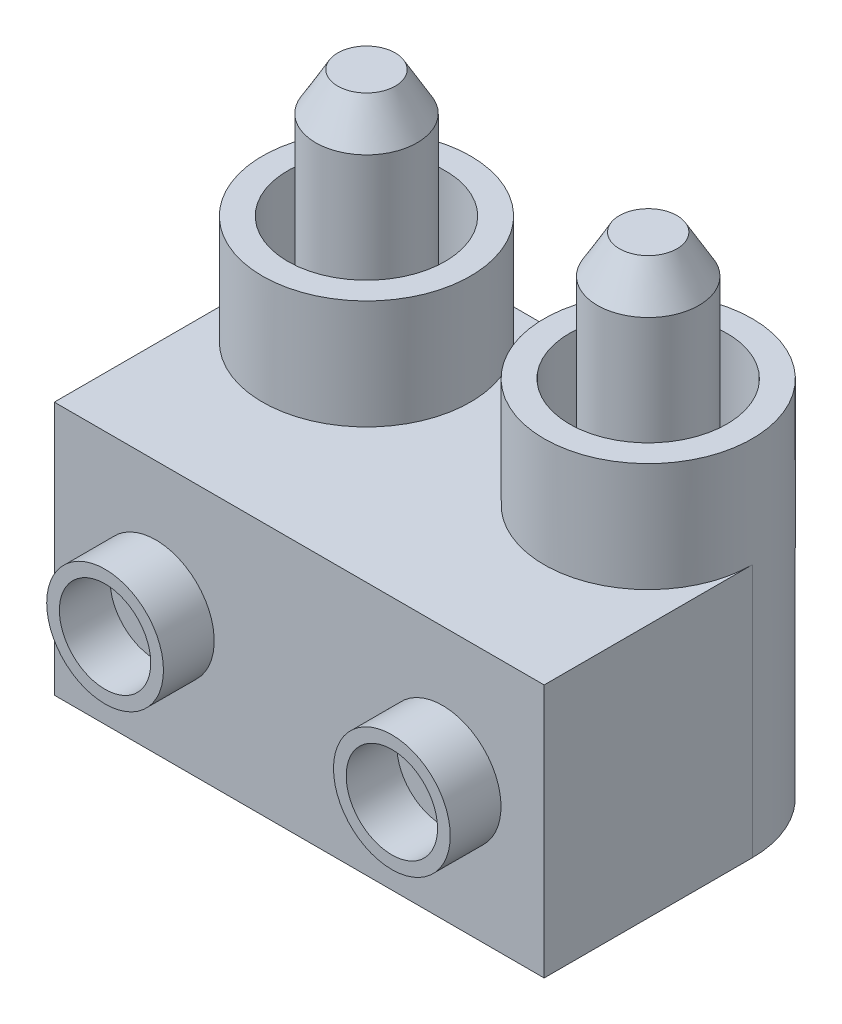
ISO-10303-21;
HEADER;
FILE_DESCRIPTION(('STEP AP214'),'2;1');
FILE_NAME('part.step','',(''),(''),'','','');
FILE_SCHEMA(('AUTOMOTIVE_DESIGN { 1 0 10303 214 1 1 1 1 }'));
ENDSEC;
DATA;
#1=APPLICATION_CONTEXT('core data for automotive mechanical design processes');
#2=APPLICATION_PROTOCOL_DEFINITION('international standard','automotive_design',2000,#1);
#3=PRODUCT_CONTEXT('',#1,'mechanical');
#4=PRODUCT('Part','Part','',(#3));
#5=PRODUCT_RELATED_PRODUCT_CATEGORY('part','',(#4));
#6=PRODUCT_DEFINITION_FORMATION('','',#4);
#7=PRODUCT_DEFINITION_CONTEXT('part definition',#1,'design');
#8=PRODUCT_DEFINITION('design','',#6,#7);
#9=PRODUCT_DEFINITION_SHAPE('','',#8);
#10=(LENGTH_UNIT() NAMED_UNIT(*) SI_UNIT(.MILLI.,.METRE.));
#11=(NAMED_UNIT(*) PLANE_ANGLE_UNIT() SI_UNIT($,.RADIAN.));
#12=(NAMED_UNIT(*) SI_UNIT($,.STERADIAN.) SOLID_ANGLE_UNIT());
#13=UNCERTAINTY_MEASURE_WITH_UNIT(LENGTH_MEASURE(1.E-05),#10,'distance_accuracy_value','');
#14=(GEOMETRIC_REPRESENTATION_CONTEXT(3) GLOBAL_UNCERTAINTY_ASSIGNED_CONTEXT((#13)) GLOBAL_UNIT_ASSIGNED_CONTEXT((#10,
#11,#12)) REPRESENTATION_CONTEXT('',''));
#15=CARTESIAN_POINT('',(0.,0.,0.));
#16=DIRECTION('',(0.,0.,1.));
#17=DIRECTION('',(1.,0.,0.));
#18=AXIS2_PLACEMENT_3D('',#15,#16,#17);
#19=CARTESIAN_POINT('',(5.55,19.3,-2.05));
#20=DIRECTION('',(0.,-1.,0.));
#21=DIRECTION('',(0.,0.,-1.));
#22=AXIS2_PLACEMENT_3D('',#19,#20,#21);
#23=CYLINDRICAL_SURFACE('',#22,2.);
#24=CARTESIAN_POINT('',(5.55,17.8,-2.05));
#25=DIRECTION('',(0.,1.,0.));
#26=DIRECTION('',(0.,0.,1.));
#27=AXIS2_PLACEMENT_3D('',#24,#25,#26);
#28=CIRCLE('',#27,2.);
#29=CARTESIAN_POINT('',(5.55,17.8,-0.0500000000000001));
#30=VERTEX_POINT('',#29);
#31=EDGE_CURVE('E11',#30,#30,#28,.F.);
#32=ORIENTED_EDGE('',*,*,#31,.T.);
#33=EDGE_LOOP('',(#32));
#34=FACE_BOUND('',#33,.T.);
#35=CARTESIAN_POINT('',(5.55,10.,-2.05));
#36=DIRECTION('',(0.,1.,0.));
#37=DIRECTION('',(0.,0.,1.));
#38=AXIS2_PLACEMENT_3D('',#35,#36,#37);
#39=CIRCLE('',#38,2.);
#40=CARTESIAN_POINT('',(5.55,10.,-0.0500000000000001));
#41=VERTEX_POINT('',#40);
#42=EDGE_CURVE('E68',#41,#41,#39,.T.);
#43=ORIENTED_EDGE('',*,*,#42,.T.);
#44=EDGE_LOOP('',(#43));
#45=FACE_BOUND('',#44,.T.);
#46=ADVANCED_FACE('F56',(#34,#45),#23,.T.);
#47=CARTESIAN_POINT('',(5.55,19.3,-2.05));
#48=DIRECTION('',(0.,1.,0.));
#49=DIRECTION('',(0.,0.,1.));
#50=AXIS2_PLACEMENT_3D('',#47,#48,#49);
#51=PLANE('',#50);
#52=CARTESIAN_POINT('',(5.55,19.3,-2.05));
#53=DIRECTION('',(0.,1.,0.));
#54=DIRECTION('',(0.,0.,1.));
#55=AXIS2_PLACEMENT_3D('',#52,#53,#54);
#56=CIRCLE('',#55,1.13397459621556);
#57=CARTESIAN_POINT('',(5.55,19.3,-0.91602540378444));
#58=VERTEX_POINT('',#57);
#59=EDGE_CURVE('E64',#58,#58,#56,.T.);
#60=ORIENTED_EDGE('',*,*,#59,.T.);
#61=EDGE_LOOP('',(#60));
#62=FACE_BOUND('',#61,.T.);
#63=ADVANCED_FACE('F78',(#62),#51,.T.);
#64=CARTESIAN_POINT('',(5.55,10.,-2.05));
#65=DIRECTION('',(0.,1.,0.));
#66=DIRECTION('',(0.,0.,1.));
#67=AXIS2_PLACEMENT_3D('',#64,#65,#66);
#68=PLANE('',#67);
#69=ORIENTED_EDGE('',*,*,#42,.F.);
#70=EDGE_LOOP('',(#69));
#71=FACE_BOUND('',#70,.T.);
#72=ADVANCED_FACE('F76',(#71),#68,.F.);
#73=CARTESIAN_POINT('',(5.55,19.3,-2.05));
#74=DIRECTION('',(0.,-1.,0.));
#75=DIRECTION('',(0.,0.,-1.));
#76=AXIS2_PLACEMENT_3D('',#73,#74,#75);
#77=CONICAL_SURFACE('',#76,1.13397459621556,0.523598775598296);
#78=ORIENTED_EDGE('',*,*,#31,.F.);
#79=EDGE_LOOP('',(#78));
#80=FACE_BOUND('',#79,.T.);
#81=ORIENTED_EDGE('',*,*,#59,.F.);
#82=EDGE_LOOP('',(#81));
#83=FACE_BOUND('',#82,.T.);
#84=ADVANCED_FACE('F59',(#80,#83),#77,.T.);
#85=CLOSED_SHELL('',(#46,#63,#72,#84));
#86=MANIFOLD_SOLID_BREP('B2',#85);
#87=CARTESIAN_POINT('',(-5.55,19.3,-2.05));
#88=DIRECTION('',(0.,-1.,0.));
#89=DIRECTION('',(0.,0.,-1.));
#90=AXIS2_PLACEMENT_3D('',#87,#88,#89);
#91=CYLINDRICAL_SURFACE('',#90,2.);
#92=CARTESIAN_POINT('',(-5.55,17.8,-2.05));
#93=DIRECTION('',(0.,1.,0.));
#94=DIRECTION('',(0.,0.,1.));
#95=AXIS2_PLACEMENT_3D('',#92,#93,#94);
#96=CIRCLE('',#95,2.);
#97=CARTESIAN_POINT('',(-5.55,17.8,-0.0500000000000001));
#98=VERTEX_POINT('',#97);
#99=EDGE_CURVE('E55',#98,#98,#96,.F.);
#100=ORIENTED_EDGE('',*,*,#99,.T.);
#101=EDGE_LOOP('',(#100));
#102=FACE_BOUND('',#101,.T.);
#103=CARTESIAN_POINT('',(-5.55,10.,-2.05));
#104=DIRECTION('',(0.,1.,0.));
#105=DIRECTION('',(0.,0.,1.));
#106=AXIS2_PLACEMENT_3D('',#103,#104,#105);
#107=CIRCLE('',#106,2.);
#108=CARTESIAN_POINT('',(-5.55,10.,-0.0500000000000001));
#109=VERTEX_POINT('',#108);
#110=EDGE_CURVE('E148',#109,#109,#107,.T.);
#111=ORIENTED_EDGE('',*,*,#110,.T.);
#112=EDGE_LOOP('',(#111));
#113=FACE_BOUND('',#112,.T.);
#114=ADVANCED_FACE('F136',(#102,#113),#91,.T.);
#115=CARTESIAN_POINT('',(-5.55,19.3,-2.05));
#116=DIRECTION('',(0.,1.,0.));
#117=DIRECTION('',(0.,0.,1.));
#118=AXIS2_PLACEMENT_3D('',#115,#116,#117);
#119=PLANE('',#118);
#120=CARTESIAN_POINT('',(-5.55,19.3,-2.05));
#121=DIRECTION('',(0.,1.,0.));
#122=DIRECTION('',(0.,0.,1.));
#123=AXIS2_PLACEMENT_3D('',#120,#121,#122);
#124=CIRCLE('',#123,1.13397459621556);
#125=CARTESIAN_POINT('',(-5.55,19.3,-0.91602540378444));
#126=VERTEX_POINT('',#125);
#127=EDGE_CURVE('E144',#126,#126,#124,.T.);
#128=ORIENTED_EDGE('',*,*,#127,.T.);
#129=EDGE_LOOP('',(#128));
#130=FACE_BOUND('',#129,.T.);
#131=ADVANCED_FACE('F158',(#130),#119,.T.);
#132=CARTESIAN_POINT('',(-5.55,10.,-2.05));
#133=DIRECTION('',(0.,1.,0.));
#134=DIRECTION('',(0.,0.,1.));
#135=AXIS2_PLACEMENT_3D('',#132,#133,#134);
#136=PLANE('',#135);
#137=ORIENTED_EDGE('',*,*,#110,.F.);
#138=EDGE_LOOP('',(#137));
#139=FACE_BOUND('',#138,.T.);
#140=ADVANCED_FACE('F156',(#139),#136,.F.);
#141=CARTESIAN_POINT('',(-5.55,19.3,-2.05));
#142=DIRECTION('',(0.,-1.,0.));
#143=DIRECTION('',(0.,0.,-1.));
#144=AXIS2_PLACEMENT_3D('',#141,#142,#143);
#145=CONICAL_SURFACE('',#144,1.13397459621556,0.523598775598296);
#146=ORIENTED_EDGE('',*,*,#99,.F.);
#147=EDGE_LOOP('',(#146));
#148=FACE_BOUND('',#147,.T.);
#149=ORIENTED_EDGE('',*,*,#127,.F.);
#150=EDGE_LOOP('',(#149));
#151=FACE_BOUND('',#150,.T.);
#152=ADVANCED_FACE('F139',(#148,#151),#145,.T.);
#153=CLOSED_SHELL('',(#114,#131,#140,#152));
#154=MANIFOLD_SOLID_BREP('B6',#153);
#155=CARTESIAN_POINT('',(9.65,10.,-2.04999999999997));
#156=DIRECTION('',(-1.,0.,0.));
#157=DIRECTION('',(0.,0.,1.));
#158=AXIS2_PLACEMENT_3D('',#155,#156,#157);
#159=PLANE('',#158);
#160=DIRECTION('',(0.,0.,-1.));
#161=VECTOR('',#160,1.);
#162=CARTESIAN_POINT('',(9.65,0.,-2.04999999999997));
#163=LINE('',#162,#161);
#164=CARTESIAN_POINT('',(9.65,0.,6.15));
#165=VERTEX_POINT('',#164);
#166=CARTESIAN_POINT('',(9.65,0.,-2.04999999999997));
#167=VERTEX_POINT('',#166);
#168=EDGE_CURVE('E285',#165,#167,#163,.T.);
#169=ORIENTED_EDGE('',*,*,#168,.T.);
#170=DIRECTION('',(0.,-1.,0.));
#171=VECTOR('',#170,1.);
#172=CARTESIAN_POINT('',(9.65,10.,-2.04999999999997));
#173=LINE('',#172,#171);
#174=CARTESIAN_POINT('',(9.65,10.,-2.05));
#175=VERTEX_POINT('',#174);
#176=EDGE_CURVE('E271',#175,#167,#173,.T.);
#177=ORIENTED_EDGE('',*,*,#176,.F.);
#178=DIRECTION('',(0.,0.,-1.));
#179=VECTOR('',#178,1.);
#180=CARTESIAN_POINT('',(9.65,10.,-2.04999999999997));
#181=LINE('',#180,#179);
#182=CARTESIAN_POINT('',(9.65,10.,6.15));
#183=VERTEX_POINT('',#182);
#184=EDGE_CURVE('E279',#183,#175,#181,.T.);
#185=ORIENTED_EDGE('',*,*,#184,.F.);
#186=DIRECTION('',(0.,-1.,0.));
#187=VECTOR('',#186,1.);
#188=CARTESIAN_POINT('',(9.65,10.,6.15));
#189=LINE('',#188,#187);
#190=EDGE_CURVE('E365',#183,#165,#189,.T.);
#191=ORIENTED_EDGE('',*,*,#190,.T.);
#192=EDGE_LOOP('',(#169,#177,#185,#191));
#193=FACE_BOUND('',#192,.T.);
#194=ADVANCED_FACE('F207',(#193),#159,.F.);
#195=CARTESIAN_POINT('',(5.55,10.,-2.05));
#196=DIRECTION('',(0.,-1.,0.));
#197=DIRECTION('',(0.,0.,-1.));
#198=AXIS2_PLACEMENT_3D('',#195,#196,#197);
#199=CYLINDRICAL_SURFACE('',#198,4.1);
#200=CARTESIAN_POINT('',(5.55,0.,-2.05));
#201=DIRECTION('',(0.,1.,0.));
#202=DIRECTION('',(0.,0.,1.));
#203=AXIS2_PLACEMENT_3D('',#200,#201,#202);
#204=CIRCLE('',#203,4.1);
#205=CARTESIAN_POINT('',(5.54999999999997,0.,-6.15));
#206=VERTEX_POINT('',#205);
#207=EDGE_CURVE('E355',#167,#206,#204,.T.);
#208=ORIENTED_EDGE('',*,*,#207,.T.);
#209=DIRECTION('',(0.,-1.,0.));
#210=VECTOR('',#209,1.);
#211=CARTESIAN_POINT('',(5.54999999999997,10.,-6.15));
#212=LINE('',#211,#210);
#213=CARTESIAN_POINT('',(5.54999999999997,10.,-6.15));
#214=VERTEX_POINT('',#213);
#215=EDGE_CURVE('E274',#214,#206,#212,.T.);
#216=ORIENTED_EDGE('',*,*,#215,.F.);
#217=CARTESIAN_POINT('',(5.55,10.,-2.05));
#218=DIRECTION('',(0.,1.,0.));
#219=DIRECTION('',(0.,0.,1.));
#220=AXIS2_PLACEMENT_3D('',#217,#218,#219);
#221=CIRCLE('',#220,4.1);
#222=EDGE_CURVE('E259',#175,#214,#221,.F.);
#223=ORIENTED_EDGE('',*,*,#222,.F.);
#224=ORIENTED_EDGE('',*,*,#176,.T.);
#225=EDGE_LOOP('',(#208,#216,#223,#224));
#226=FACE_BOUND('',#225,.T.);
#227=CARTESIAN_POINT('',(5.55,14.3,-2.05));
#228=DIRECTION('',(0.,1.,0.));
#229=DIRECTION('',(0.,0.,1.));
#230=AXIS2_PLACEMENT_3D('',#227,#228,#229);
#231=CIRCLE('',#230,4.1);
#232=CARTESIAN_POINT('',(5.55,14.3,2.05));
#233=VERTEX_POINT('',#232);
#234=EDGE_CURVE('E439',#233,#233,#231,.T.);
#235=ORIENTED_EDGE('',*,*,#234,.F.);
#236=EDGE_LOOP('',(#235));
#237=FACE_BOUND('',#236,.T.);
#238=ADVANCED_FACE('F268',(#226,#237),#199,.T.);
#239=CARTESIAN_POINT('',(-5.54999999999997,10.,-6.15));
#240=DIRECTION('',(0.,0.,1.));
#241=DIRECTION('',(1.,0.,0.));
#242=AXIS2_PLACEMENT_3D('',#239,#240,#241);
#243=PLANE('',#242);
#244=DIRECTION('',(-1.,0.,0.));
#245=VECTOR('',#244,1.);
#246=CARTESIAN_POINT('',(-5.54999999999997,0.,-6.15));
#247=LINE('',#246,#245);
#248=CARTESIAN_POINT('',(-5.54999999999997,0.,-6.15));
#249=VERTEX_POINT('',#248);
#250=EDGE_CURVE('E368',#206,#249,#247,.T.);
#251=ORIENTED_EDGE('',*,*,#250,.T.);
#252=DIRECTION('',(0.,-1.,0.));
#253=VECTOR('',#252,1.);
#254=CARTESIAN_POINT('',(-5.54999999999997,10.,-6.15));
#255=LINE('',#254,#253);
#256=CARTESIAN_POINT('',(-5.55,10.,-6.15));
#257=VERTEX_POINT('',#256);
#258=EDGE_CURVE('E290',#257,#249,#255,.T.);
#259=ORIENTED_EDGE('',*,*,#258,.F.);
#260=DIRECTION('',(-1.,0.,0.));
#261=VECTOR('',#260,1.);
#262=CARTESIAN_POINT('',(-5.54999999999997,10.,-6.15));
#263=LINE('',#262,#261);
#264=EDGE_CURVE('E282',#214,#257,#263,.T.);
#265=ORIENTED_EDGE('',*,*,#264,.F.);
#266=ORIENTED_EDGE('',*,*,#215,.T.);
#267=EDGE_LOOP('',(#251,#259,#265,#266));
#268=FACE_BOUND('',#267,.T.);
#269=ADVANCED_FACE('F333',(#268),#243,.F.);
#270=CARTESIAN_POINT('',(-5.55,10.,-2.05));
#271=DIRECTION('',(0.,-1.,0.));
#272=DIRECTION('',(0.,0.,-1.));
#273=AXIS2_PLACEMENT_3D('',#270,#271,#272);
#274=CYLINDRICAL_SURFACE('',#273,4.1);
#275=CARTESIAN_POINT('',(-5.55,0.,-2.05));
#276=DIRECTION('',(0.,1.,0.));
#277=DIRECTION('',(0.,0.,1.));
#278=AXIS2_PLACEMENT_3D('',#275,#276,#277);
#279=CIRCLE('',#278,4.1);
#280=CARTESIAN_POINT('',(-9.65,0.,-2.04999999999997));
#281=VERTEX_POINT('',#280);
#282=EDGE_CURVE('E348',#249,#281,#279,.T.);
#283=ORIENTED_EDGE('',*,*,#282,.T.);
#284=DIRECTION('',(0.,-1.,0.));
#285=VECTOR('',#284,1.);
#286=CARTESIAN_POINT('',(-9.65,10.,-2.04999999999997));
#287=LINE('',#286,#285);
#288=CARTESIAN_POINT('',(-9.65,10.,-2.04999999999997));
#289=VERTEX_POINT('',#288);
#290=EDGE_CURVE('E376',#289,#281,#287,.T.);
#291=ORIENTED_EDGE('',*,*,#290,.F.);
#292=CARTESIAN_POINT('',(-5.55,10.,-2.05));
#293=DIRECTION('',(0.,1.,0.));
#294=DIRECTION('',(0.,0.,1.));
#295=AXIS2_PLACEMENT_3D('',#292,#293,#294);
#296=CIRCLE('',#295,4.1);
#297=EDGE_CURVE('E286',#289,#257,#296,.T.);
#298=ORIENTED_EDGE('',*,*,#297,.T.);
#299=ORIENTED_EDGE('',*,*,#258,.T.);
#300=EDGE_LOOP('',(#283,#291,#298,#299));
#301=FACE_BOUND('',#300,.T.);
#302=CARTESIAN_POINT('',(-5.55,14.3,-2.05));
#303=DIRECTION('',(0.,1.,0.));
#304=DIRECTION('',(0.,0.,1.));
#305=AXIS2_PLACEMENT_3D('',#302,#303,#304);
#306=CIRCLE('',#305,4.1);
#307=CARTESIAN_POINT('',(-5.55,14.3,2.05));
#308=VERTEX_POINT('',#307);
#309=EDGE_CURVE('E351',#308,#308,#306,.T.);
#310=ORIENTED_EDGE('',*,*,#309,.F.);
#311=EDGE_LOOP('',(#310));
#312=FACE_BOUND('',#311,.T.);
#313=ADVANCED_FACE('F317',(#301,#312),#274,.T.);
#314=CARTESIAN_POINT('',(-9.65,10.,-2.04999999999997));
#315=DIRECTION('',(1.,0.,0.));
#316=DIRECTION('',(0.,0.,-1.));
#317=AXIS2_PLACEMENT_3D('',#314,#315,#316);
#318=PLANE('',#317);
#319=DIRECTION('',(0.,0.,1.));
#320=VECTOR('',#319,1.);
#321=CARTESIAN_POINT('',(-9.65,0.,-2.04999999999997));
#322=LINE('',#321,#320);
#323=CARTESIAN_POINT('',(-9.65,0.,6.15));
#324=VERTEX_POINT('',#323);
#325=EDGE_CURVE('E247',#281,#324,#322,.T.);
#326=ORIENTED_EDGE('',*,*,#325,.T.);
#327=DIRECTION('',(0.,-1.,0.));
#328=VECTOR('',#327,1.);
#329=CARTESIAN_POINT('',(-9.65,10.,6.15));
#330=LINE('',#329,#328);
#331=CARTESIAN_POINT('',(-9.65,10.,6.15));
#332=VERTEX_POINT('',#331);
#333=EDGE_CURVE('E374',#332,#324,#330,.T.);
#334=ORIENTED_EDGE('',*,*,#333,.F.);
#335=DIRECTION('',(0.,0.,1.));
#336=VECTOR('',#335,1.);
#337=CARTESIAN_POINT('',(-9.65,10.,-2.04999999999997));
#338=LINE('',#337,#336);
#339=EDGE_CURVE('E363',#289,#332,#338,.T.);
#340=ORIENTED_EDGE('',*,*,#339,.F.);
#341=ORIENTED_EDGE('',*,*,#290,.T.);
#342=EDGE_LOOP('',(#326,#334,#340,#341));
#343=FACE_BOUND('',#342,.T.);
#344=ADVANCED_FACE('F302',(#343),#318,.F.);
#345=CARTESIAN_POINT('',(-9.65,10.,6.15));
#346=DIRECTION('',(0.,0.,-1.));
#347=DIRECTION('',(-1.,0.,0.));
#348=AXIS2_PLACEMENT_3D('',#345,#346,#347);
#349=PLANE('',#348);
#350=CARTESIAN_POINT('',(5.65,5.,6.15));
#351=DIRECTION('',(0.,0.,-1.));
#352=DIRECTION('',(-1.,0.,0.));
#353=AXIS2_PLACEMENT_3D('',#350,#351,#352);
#354=CIRCLE('',#353,2.3);
#355=CARTESIAN_POINT('',(3.35,5.,6.15));
#356=VERTEX_POINT('',#355);
#357=EDGE_CURVE('E134',#356,#356,#354,.F.);
#358=ORIENTED_EDGE('',*,*,#357,.F.);
#359=EDGE_LOOP('',(#358));
#360=FACE_BOUND('',#359,.T.);
#361=CARTESIAN_POINT('',(-5.65,5.,6.15));
#362=DIRECTION('',(0.,0.,-1.));
#363=DIRECTION('',(-1.,0.,0.));
#364=AXIS2_PLACEMENT_3D('',#361,#362,#363);
#365=CIRCLE('',#364,2.3);
#366=CARTESIAN_POINT('',(-7.95,5.,6.15));
#367=VERTEX_POINT('',#366);
#368=EDGE_CURVE('E215',#367,#367,#365,.F.);
#369=ORIENTED_EDGE('',*,*,#368,.F.);
#370=EDGE_LOOP('',(#369));
#371=FACE_BOUND('',#370,.T.);
#372=DIRECTION('',(1.,0.,0.));
#373=VECTOR('',#372,1.);
#374=CARTESIAN_POINT('',(-9.65,0.,6.15));
#375=LINE('',#374,#373);
#376=EDGE_CURVE('E253',#324,#165,#375,.T.);
#377=ORIENTED_EDGE('',*,*,#376,.T.);
#378=ORIENTED_EDGE('',*,*,#190,.F.);
#379=DIRECTION('',(1.,0.,0.));
#380=VECTOR('',#379,1.);
#381=CARTESIAN_POINT('',(-9.65,10.,6.15));
#382=LINE('',#381,#380);
#383=EDGE_CURVE('E223',#332,#183,#382,.T.);
#384=ORIENTED_EDGE('',*,*,#383,.F.);
#385=ORIENTED_EDGE('',*,*,#333,.T.);
#386=EDGE_LOOP('',(#377,#378,#384,#385));
#387=FACE_BOUND('',#386,.T.);
#388=ADVANCED_FACE('F300',(#360,#371,#387),#349,.F.);
#389=CARTESIAN_POINT('',(-5.55,10.,-2.05));
#390=DIRECTION('',(0.,1.,0.));
#391=DIRECTION('',(0.,0.,1.));
#392=AXIS2_PLACEMENT_3D('',#389,#390,#391);
#393=PLANE('',#392);
#394=ORIENTED_EDGE('',*,*,#184,.T.);
#395=ORIENTED_EDGE('',*,*,#222,.T.);
#396=ORIENTED_EDGE('',*,*,#264,.T.);
#397=ORIENTED_EDGE('',*,*,#297,.F.);
#398=ORIENTED_EDGE('',*,*,#339,.T.);
#399=ORIENTED_EDGE('',*,*,#383,.T.);
#400=EDGE_LOOP('',(#394,#395,#396,#397,#398,#399));
#401=FACE_BOUND('',#400,.T.);
#402=ADVANCED_FACE('F280',(#401),#393,.T.);
#403=CARTESIAN_POINT('',(-5.55,0.,-2.05));
#404=DIRECTION('',(0.,1.,0.));
#405=DIRECTION('',(0.,0.,1.));
#406=AXIS2_PLACEMENT_3D('',#403,#404,#405);
#407=PLANE('',#406);
#408=ORIENTED_EDGE('',*,*,#168,.F.);
#409=ORIENTED_EDGE('',*,*,#376,.F.);
#410=ORIENTED_EDGE('',*,*,#325,.F.);
#411=ORIENTED_EDGE('',*,*,#282,.F.);
#412=ORIENTED_EDGE('',*,*,#250,.F.);
#413=ORIENTED_EDGE('',*,*,#207,.F.);
#414=EDGE_LOOP('',(#408,#409,#410,#411,#412,#413));
#415=FACE_BOUND('',#414,.T.);
#416=ADVANCED_FACE('F312',(#415),#407,.F.);
#417=CARTESIAN_POINT('',(-5.55,14.3,-2.05));
#418=DIRECTION('',(0.,1.,0.));
#419=DIRECTION('',(0.,0.,1.));
#420=AXIS2_PLACEMENT_3D('',#417,#418,#419);
#421=PLANE('',#420);
#422=ORIENTED_EDGE('',*,*,#309,.T.);
#423=EDGE_LOOP('',(#422));
#424=FACE_BOUND('',#423,.T.);
#425=CARTESIAN_POINT('',(-5.55,14.3,-2.05));
#426=DIRECTION('',(0.,1.,0.));
#427=DIRECTION('',(0.,0.,1.));
#428=AXIS2_PLACEMENT_3D('',#425,#426,#427);
#429=CIRCLE('',#428,3.1);
#430=CARTESIAN_POINT('',(-5.55,14.3,1.05));
#431=VERTEX_POINT('',#430);
#432=EDGE_CURVE('E353',#431,#431,#429,.T.);
#433=ORIENTED_EDGE('',*,*,#432,.F.);
#434=EDGE_LOOP('',(#433));
#435=FACE_BOUND('',#434,.T.);
#436=ADVANCED_FACE('F380',(#424,#435),#421,.T.);
#437=CARTESIAN_POINT('',(-5.55,14.3,-2.05));
#438=DIRECTION('',(0.,-1.,0.));
#439=DIRECTION('',(0.,0.,-1.));
#440=AXIS2_PLACEMENT_3D('',#437,#438,#439);
#441=CYLINDRICAL_SURFACE('',#440,3.1);
#442=ORIENTED_EDGE('',*,*,#432,.T.);
#443=EDGE_LOOP('',(#442));
#444=FACE_BOUND('',#443,.T.);
#445=CARTESIAN_POINT('',(-5.55,10.,-2.05));
#446=DIRECTION('',(0.,1.,0.));
#447=DIRECTION('',(0.,0.,1.));
#448=AXIS2_PLACEMENT_3D('',#445,#446,#447);
#449=CIRCLE('',#448,3.1);
#450=CARTESIAN_POINT('',(-5.55,10.,1.05));
#451=VERTEX_POINT('',#450);
#452=EDGE_CURVE('E358',#451,#451,#449,.T.);
#453=ORIENTED_EDGE('',*,*,#452,.F.);
#454=EDGE_LOOP('',(#453));
#455=FACE_BOUND('',#454,.T.);
#456=ADVANCED_FACE('F384',(#444,#455),#441,.F.);
#457=ORIENTED_EDGE('',*,*,#452,.T.);
#458=EDGE_LOOP('',(#457));
#459=FACE_BOUND('',#458,.T.);
#460=ADVANCED_FACE('F315',(#459),#393,.T.);
#461=CARTESIAN_POINT('',(5.55,14.3,-2.05));
#462=DIRECTION('',(0.,1.,0.));
#463=DIRECTION('',(0.,0.,1.));
#464=AXIS2_PLACEMENT_3D('',#461,#462,#463);
#465=PLANE('',#464);
#466=ORIENTED_EDGE('',*,*,#234,.T.);
#467=EDGE_LOOP('',(#466));
#468=FACE_BOUND('',#467,.T.);
#469=CARTESIAN_POINT('',(5.55,14.3,-2.05));
#470=DIRECTION('',(0.,1.,0.));
#471=DIRECTION('',(0.,0.,1.));
#472=AXIS2_PLACEMENT_3D('',#469,#470,#471);
#473=CIRCLE('',#472,3.1);
#474=CARTESIAN_POINT('',(5.55,14.3,1.05));
#475=VERTEX_POINT('',#474);
#476=EDGE_CURVE('E442',#475,#475,#473,.T.);
#477=ORIENTED_EDGE('',*,*,#476,.F.);
#478=EDGE_LOOP('',(#477));
#479=FACE_BOUND('',#478,.T.);
#480=ADVANCED_FACE('F393',(#468,#479),#465,.T.);
#481=CARTESIAN_POINT('',(5.55,14.3,-2.05));
#482=DIRECTION('',(0.,-1.,0.));
#483=DIRECTION('',(0.,0.,-1.));
#484=AXIS2_PLACEMENT_3D('',#481,#482,#483);
#485=CYLINDRICAL_SURFACE('',#484,3.1);
#486=ORIENTED_EDGE('',*,*,#476,.T.);
#487=EDGE_LOOP('',(#486));
#488=FACE_BOUND('',#487,.T.);
#489=CARTESIAN_POINT('',(5.55,10.,-2.05));
#490=DIRECTION('',(0.,1.,0.));
#491=DIRECTION('',(0.,0.,1.));
#492=AXIS2_PLACEMENT_3D('',#489,#490,#491);
#493=CIRCLE('',#492,3.1);
#494=CARTESIAN_POINT('',(5.55,10.,1.05));
#495=VERTEX_POINT('',#494);
#496=EDGE_CURVE('E276',#495,#495,#493,.F.);
#497=ORIENTED_EDGE('',*,*,#496,.T.);
#498=EDGE_LOOP('',(#497));
#499=FACE_BOUND('',#498,.T.);
#500=ADVANCED_FACE('F390',(#488,#499),#485,.F.);
#501=ORIENTED_EDGE('',*,*,#496,.F.);
#502=EDGE_LOOP('',(#501));
#503=FACE_BOUND('',#502,.T.);
#504=ADVANCED_FACE('F314',(#503),#393,.T.);
#505=CARTESIAN_POINT('',(-5.65,5.,8.15));
#506=DIRECTION('',(0.,0.,1.));
#507=DIRECTION('',(1.,0.,0.));
#508=AXIS2_PLACEMENT_3D('',#505,#506,#507);
#509=PLANE('',#508);
#510=CARTESIAN_POINT('',(-5.65,5.,8.15));
#511=DIRECTION('',(0.,0.,1.));
#512=DIRECTION('',(1.,0.,0.));
#513=AXIS2_PLACEMENT_3D('',#510,#511,#512);
#514=CIRCLE('',#513,2.3);
#515=CARTESIAN_POINT('',(-3.35,5.,8.15));
#516=VERTEX_POINT('',#515);
#517=EDGE_CURVE('E434',#516,#516,#514,.T.);
#518=ORIENTED_EDGE('',*,*,#517,.T.);
#519=EDGE_LOOP('',(#518));
#520=FACE_BOUND('',#519,.T.);
#521=CARTESIAN_POINT('',(-5.65,5.,8.15));
#522=DIRECTION('',(0.,0.,1.));
#523=DIRECTION('',(1.,0.,0.));
#524=AXIS2_PLACEMENT_3D('',#521,#522,#523);
#525=CIRCLE('',#524,1.8);
#526=CARTESIAN_POINT('',(-3.85,5.,8.15));
#527=VERTEX_POINT('',#526);
#528=EDGE_CURVE('E431',#527,#527,#525,.T.);
#529=ORIENTED_EDGE('',*,*,#528,.F.);
#530=EDGE_LOOP('',(#529));
#531=FACE_BOUND('',#530,.T.);
#532=ADVANCED_FACE('F400',(#520,#531),#509,.T.);
#533=CARTESIAN_POINT('',(-5.65,5.,8.15));
#534=DIRECTION('',(0.,0.,-1.));
#535=DIRECTION('',(-1.,0.,0.));
#536=AXIS2_PLACEMENT_3D('',#533,#534,#535);
#537=CYLINDRICAL_SURFACE('',#536,2.3);
#538=ORIENTED_EDGE('',*,*,#517,.F.);
#539=EDGE_LOOP('',(#538));
#540=FACE_BOUND('',#539,.T.);
#541=ORIENTED_EDGE('',*,*,#368,.T.);
#542=EDGE_LOOP('',(#541));
#543=FACE_BOUND('',#542,.T.);
#544=ADVANCED_FACE('F298',(#540,#543),#537,.T.);
#545=CARTESIAN_POINT('',(-5.65,5.,8.15));
#546=DIRECTION('',(0.,0.,-1.));
#547=DIRECTION('',(-1.,0.,0.));
#548=AXIS2_PLACEMENT_3D('',#545,#546,#547);
#549=CYLINDRICAL_SURFACE('',#548,1.8);
#550=ORIENTED_EDGE('',*,*,#528,.T.);
#551=EDGE_LOOP('',(#550));
#552=FACE_BOUND('',#551,.T.);
#553=CARTESIAN_POINT('',(-5.65,5.,6.15));
#554=DIRECTION('',(0.,0.,1.));
#555=DIRECTION('',(1.,0.,0.));
#556=AXIS2_PLACEMENT_3D('',#553,#554,#555);
#557=CIRCLE('',#556,1.8);
#558=CARTESIAN_POINT('',(-3.85,5.,6.15));
#559=VERTEX_POINT('',#558);
#560=EDGE_CURVE('E429',#559,#559,#557,.T.);
#561=ORIENTED_EDGE('',*,*,#560,.F.);
#562=EDGE_LOOP('',(#561));
#563=FACE_BOUND('',#562,.T.);
#564=ADVANCED_FACE('F326',(#552,#563),#549,.F.);
#565=ORIENTED_EDGE('',*,*,#560,.T.);
#566=EDGE_LOOP('',(#565));
#567=FACE_BOUND('',#566,.T.);
#568=ADVANCED_FACE('F306',(#567),#349,.F.);
#569=CARTESIAN_POINT('',(5.65,5.,8.15));
#570=DIRECTION('',(0.,0.,1.));
#571=DIRECTION('',(1.,0.,0.));
#572=AXIS2_PLACEMENT_3D('',#569,#570,#571);
#573=PLANE('',#572);
#574=CARTESIAN_POINT('',(5.65,5.,8.15));
#575=DIRECTION('',(0.,0.,1.));
#576=DIRECTION('',(1.,0.,0.));
#577=AXIS2_PLACEMENT_3D('',#574,#575,#576);
#578=CIRCLE('',#577,2.3);
#579=CARTESIAN_POINT('',(7.95,5.,8.15));
#580=VERTEX_POINT('',#579);
#581=EDGE_CURVE('E421',#580,#580,#578,.T.);
#582=ORIENTED_EDGE('',*,*,#581,.T.);
#583=EDGE_LOOP('',(#582));
#584=FACE_BOUND('',#583,.T.);
#585=CARTESIAN_POINT('',(5.65,5.,8.15));
#586=DIRECTION('',(0.,0.,1.));
#587=DIRECTION('',(1.,0.,0.));
#588=AXIS2_PLACEMENT_3D('',#585,#586,#587);
#589=CIRCLE('',#588,1.8);
#590=CARTESIAN_POINT('',(7.45,5.,8.15));
#591=VERTEX_POINT('',#590);
#592=EDGE_CURVE('E422',#591,#591,#589,.T.);
#593=ORIENTED_EDGE('',*,*,#592,.F.);
#594=EDGE_LOOP('',(#593));
#595=FACE_BOUND('',#594,.T.);
#596=ADVANCED_FACE('F325',(#584,#595),#573,.T.);
#597=CARTESIAN_POINT('',(5.65,5.,8.15));
#598=DIRECTION('',(0.,0.,-1.));
#599=DIRECTION('',(-1.,0.,0.));
#600=AXIS2_PLACEMENT_3D('',#597,#598,#599);
#601=CYLINDRICAL_SURFACE('',#600,2.3);
#602=ORIENTED_EDGE('',*,*,#581,.F.);
#603=EDGE_LOOP('',(#602));
#604=FACE_BOUND('',#603,.T.);
#605=ORIENTED_EDGE('',*,*,#357,.T.);
#606=EDGE_LOOP('',(#605));
#607=FACE_BOUND('',#606,.T.);
#608=ADVANCED_FACE('F409',(#604,#607),#601,.T.);
#609=CARTESIAN_POINT('',(5.65,5.,8.15));
#610=DIRECTION('',(0.,0.,-1.));
#611=DIRECTION('',(-1.,0.,0.));
#612=AXIS2_PLACEMENT_3D('',#609,#610,#611);
#613=CYLINDRICAL_SURFACE('',#612,1.8);
#614=ORIENTED_EDGE('',*,*,#592,.T.);
#615=EDGE_LOOP('',(#614));
#616=FACE_BOUND('',#615,.T.);
#617=CARTESIAN_POINT('',(5.65,5.,6.15));
#618=DIRECTION('',(0.,0.,1.));
#619=DIRECTION('',(1.,0.,0.));
#620=AXIS2_PLACEMENT_3D('',#617,#618,#619);
#621=CIRCLE('',#620,1.8);
#622=CARTESIAN_POINT('',(7.45,5.,6.15));
#623=VERTEX_POINT('',#622);
#624=EDGE_CURVE('E425',#623,#623,#621,.T.);
#625=ORIENTED_EDGE('',*,*,#624,.F.);
#626=EDGE_LOOP('',(#625));
#627=FACE_BOUND('',#626,.T.);
#628=ADVANCED_FACE('F322',(#616,#627),#613,.F.);
#629=ORIENTED_EDGE('',*,*,#624,.T.);
#630=EDGE_LOOP('',(#629));
#631=FACE_BOUND('',#630,.T.);
#632=ADVANCED_FACE('F305',(#631),#349,.F.);
#633=CLOSED_SHELL('',(#194,#238,#269,#313,#344,#388,#402,#416,#436,#456,#460,#480,#500,#504,
#532,#544,#564,#568,#596,#608,#628,#632));
#634=MANIFOLD_SOLID_BREP('B50',#633);
#635=ADVANCED_BREP_SHAPE_REPRESENTATION('',(#18,#86,#154,#634),#14);
#636=SHAPE_DEFINITION_REPRESENTATION(#9,#635);
ENDSEC;
END-ISO-10303-21;
